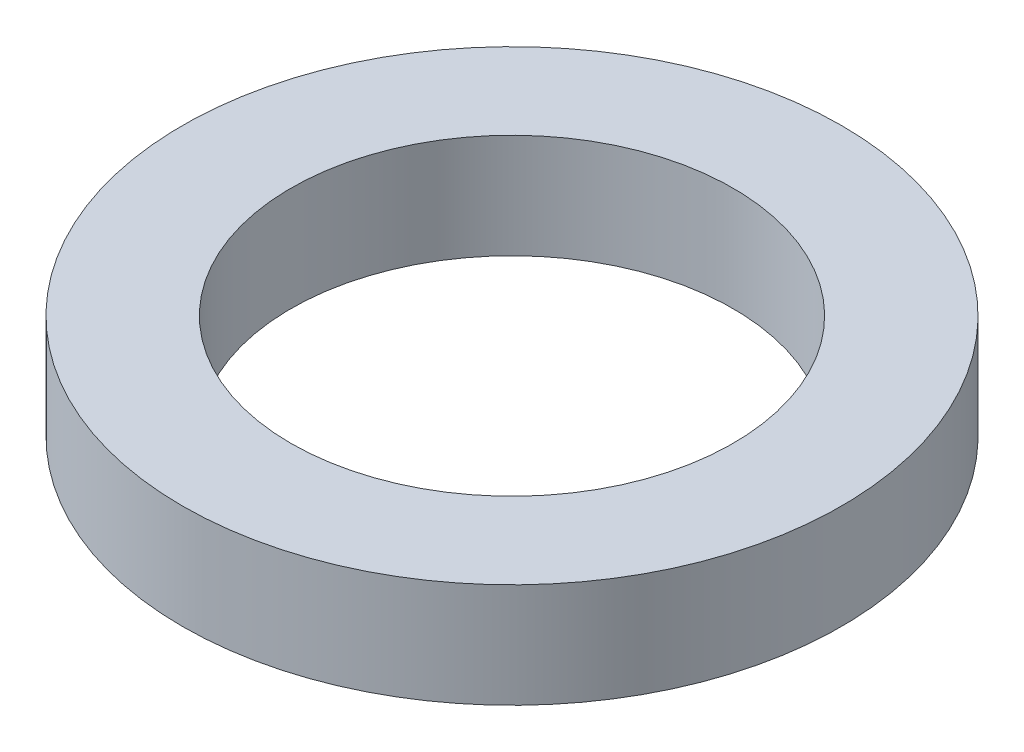
ISO-10303-21;
HEADER;
FILE_DESCRIPTION(('STEP AP214'),'2;1');
FILE_NAME('part.step','',(''),(''),'','','');
FILE_SCHEMA(('AUTOMOTIVE_DESIGN { 1 0 10303 214 1 1 1 1 }'));
ENDSEC;
DATA;
#1=APPLICATION_CONTEXT('core data for automotive mechanical design processes');
#2=APPLICATION_PROTOCOL_DEFINITION('international standard','automotive_design',2000,#1);
#3=PRODUCT_CONTEXT('',#1,'mechanical');
#4=PRODUCT('Part','Part','',(#3));
#5=PRODUCT_RELATED_PRODUCT_CATEGORY('part','',(#4));
#6=PRODUCT_DEFINITION_FORMATION('','',#4);
#7=PRODUCT_DEFINITION_CONTEXT('part definition',#1,'design');
#8=PRODUCT_DEFINITION('design','',#6,#7);
#9=PRODUCT_DEFINITION_SHAPE('','',#8);
#10=(LENGTH_UNIT() NAMED_UNIT(*) SI_UNIT(.MILLI.,.METRE.));
#11=(NAMED_UNIT(*) PLANE_ANGLE_UNIT() SI_UNIT($,.RADIAN.));
#12=(NAMED_UNIT(*) SI_UNIT($,.STERADIAN.) SOLID_ANGLE_UNIT());
#13=UNCERTAINTY_MEASURE_WITH_UNIT(LENGTH_MEASURE(1.E-05),#10,'distance_accuracy_value','');
#14=(GEOMETRIC_REPRESENTATION_CONTEXT(3) GLOBAL_UNCERTAINTY_ASSIGNED_CONTEXT((#13)) GLOBAL_UNIT_ASSIGNED_CONTEXT((#10,
#11,#12)) REPRESENTATION_CONTEXT('',''));
#15=CARTESIAN_POINT('',(0.,0.,0.));
#16=DIRECTION('',(0.,0.,1.));
#17=DIRECTION('',(1.,0.,0.));
#18=AXIS2_PLACEMENT_3D('',#15,#16,#17);
#19=CARTESIAN_POINT('',(0.,1.9,0.));
#20=DIRECTION('',(0.,1.,0.));
#21=DIRECTION('',(0.,0.,1.));
#22=AXIS2_PLACEMENT_3D('',#19,#20,#21);
#23=PLANE('',#22);
#24=CARTESIAN_POINT('',(0.,1.9,0.));
#25=DIRECTION('',(0.,1.,0.));
#26=DIRECTION('',(0.,0.,1.));
#27=AXIS2_PLACEMENT_3D('',#24,#25,#26);
#28=CIRCLE('',#27,4.025);
#29=CARTESIAN_POINT('',(0.,1.9,4.025));
#30=VERTEX_POINT('',#29);
#31=EDGE_CURVE('E26',#30,#30,#28,.F.);
#32=ORIENTED_EDGE('',*,*,#31,.T.);
#33=EDGE_LOOP('',(#32));
#34=FACE_BOUND('',#33,.T.);
#35=CARTESIAN_POINT('',(0.,1.9,0.));
#36=DIRECTION('',(0.,1.,0.));
#37=DIRECTION('',(0.,0.,1.));
#38=AXIS2_PLACEMENT_3D('',#35,#36,#37);
#39=CIRCLE('',#38,6.);
#40=CARTESIAN_POINT('',(0.,1.9,6.));
#41=VERTEX_POINT('',#40);
#42=EDGE_CURVE('E17',#41,#41,#39,.F.);
#43=ORIENTED_EDGE('',*,*,#42,.F.);
#44=EDGE_LOOP('',(#43));
#45=FACE_BOUND('',#44,.T.);
#46=ADVANCED_FACE('F14',(#34,#45),#23,.T.);
#47=CARTESIAN_POINT('',(0.,0.,0.));
#48=DIRECTION('',(0.,1.,0.));
#49=DIRECTION('',(0.,0.,1.));
#50=AXIS2_PLACEMENT_3D('',#47,#48,#49);
#51=CYLINDRICAL_SURFACE('',#50,6.);
#52=ORIENTED_EDGE('',*,*,#42,.T.);
#53=EDGE_LOOP('',(#52));
#54=FACE_BOUND('',#53,.T.);
#55=CARTESIAN_POINT('',(0.,0.,0.));
#56=DIRECTION('',(0.,1.,0.));
#57=DIRECTION('',(0.,0.,1.));
#58=AXIS2_PLACEMENT_3D('',#55,#56,#57);
#59=CIRCLE('',#58,6.);
#60=CARTESIAN_POINT('',(0.,0.,6.));
#61=VERTEX_POINT('',#60);
#62=EDGE_CURVE('E21',#61,#61,#59,.T.);
#63=ORIENTED_EDGE('',*,*,#62,.T.);
#64=EDGE_LOOP('',(#63));
#65=FACE_BOUND('',#64,.T.);
#66=ADVANCED_FACE('F34',(#54,#65),#51,.T.);
#67=CARTESIAN_POINT('',(0.,0.,0.));
#68=DIRECTION('',(0.,1.,0.));
#69=DIRECTION('',(0.,0.,1.));
#70=AXIS2_PLACEMENT_3D('',#67,#68,#69);
#71=CYLINDRICAL_SURFACE('',#70,4.025);
#72=ORIENTED_EDGE('',*,*,#31,.F.);
#73=EDGE_LOOP('',(#72));
#74=FACE_BOUND('',#73,.T.);
#75=CARTESIAN_POINT('',(0.,0.,0.));
#76=DIRECTION('',(0.,1.,0.));
#77=DIRECTION('',(0.,0.,1.));
#78=AXIS2_PLACEMENT_3D('',#75,#76,#77);
#79=CIRCLE('',#78,4.025);
#80=CARTESIAN_POINT('',(0.,0.,4.025));
#81=VERTEX_POINT('',#80);
#82=EDGE_CURVE('E10',#81,#81,#79,.F.);
#83=ORIENTED_EDGE('',*,*,#82,.T.);
#84=EDGE_LOOP('',(#83));
#85=FACE_BOUND('',#84,.T.);
#86=ADVANCED_FACE('F42',(#74,#85),#71,.F.);
#87=CARTESIAN_POINT('',(0.,0.,0.));
#88=DIRECTION('',(0.,1.,0.));
#89=DIRECTION('',(0.,0.,1.));
#90=AXIS2_PLACEMENT_3D('',#87,#88,#89);
#91=PLANE('',#90);
#92=ORIENTED_EDGE('',*,*,#82,.F.);
#93=EDGE_LOOP('',(#92));
#94=FACE_BOUND('',#93,.T.);
#95=ORIENTED_EDGE('',*,*,#62,.F.);
#96=EDGE_LOOP('',(#95));
#97=FACE_BOUND('',#96,.T.);
#98=ADVANCED_FACE('F43',(#94,#97),#91,.F.);
#99=CLOSED_SHELL('',(#46,#66,#86,#98));
#100=MANIFOLD_SOLID_BREP('B1',#99);
#101=ADVANCED_BREP_SHAPE_REPRESENTATION('',(#18,#100),#14);
#102=SHAPE_DEFINITION_REPRESENTATION(#9,#101);
ENDSEC;
END-ISO-10303-21;
